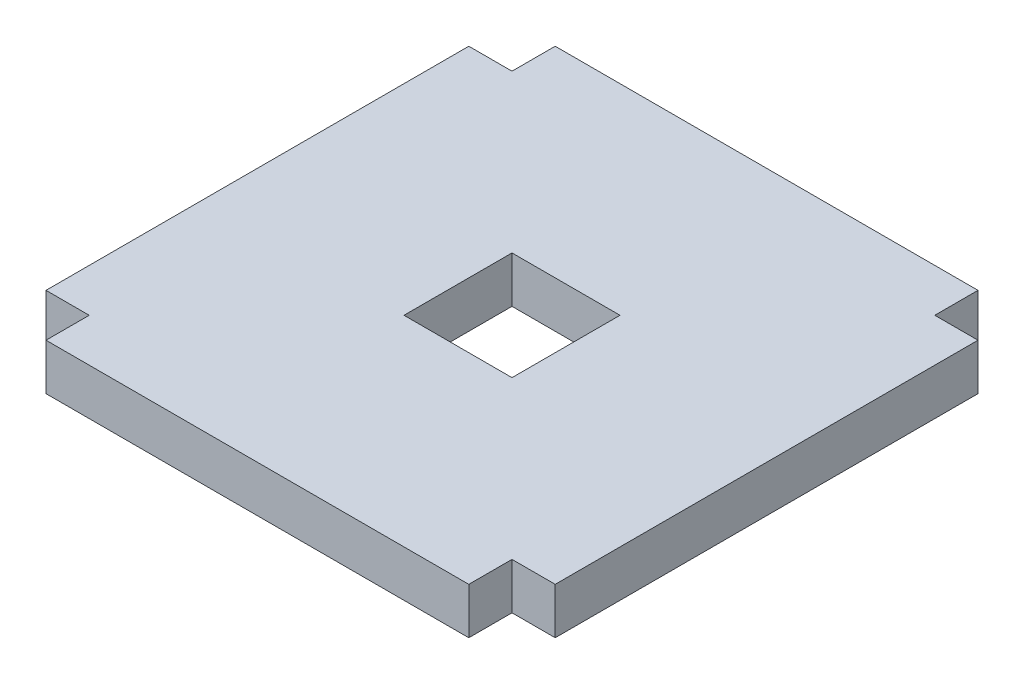
ISO-10303-21;
HEADER;
FILE_DESCRIPTION(('STEP AP214'),'2;1');
FILE_NAME('part.step','',(''),(''),'','','');
FILE_SCHEMA(('AUTOMOTIVE_DESIGN { 1 0 10303 214 1 1 1 1 }'));
ENDSEC;
DATA;
#1=APPLICATION_CONTEXT('core data for automotive mechanical design processes');
#2=APPLICATION_PROTOCOL_DEFINITION('international standard','automotive_design',2000,#1);
#3=PRODUCT_CONTEXT('',#1,'mechanical');
#4=PRODUCT('Part','Part','',(#3));
#5=PRODUCT_RELATED_PRODUCT_CATEGORY('part','',(#4));
#6=PRODUCT_DEFINITION_FORMATION('','',#4);
#7=PRODUCT_DEFINITION_CONTEXT('part definition',#1,'design');
#8=PRODUCT_DEFINITION('design','',#6,#7);
#9=PRODUCT_DEFINITION_SHAPE('','',#8);
#10=(LENGTH_UNIT() NAMED_UNIT(*) SI_UNIT(.MILLI.,.METRE.));
#11=(NAMED_UNIT(*) PLANE_ANGLE_UNIT() SI_UNIT($,.RADIAN.));
#12=(NAMED_UNIT(*) SI_UNIT($,.STERADIAN.) SOLID_ANGLE_UNIT());
#13=UNCERTAINTY_MEASURE_WITH_UNIT(LENGTH_MEASURE(1.E-05),#10,'distance_accuracy_value','');
#14=(GEOMETRIC_REPRESENTATION_CONTEXT(3) GLOBAL_UNCERTAINTY_ASSIGNED_CONTEXT((#13)) GLOBAL_UNIT_ASSIGNED_CONTEXT((#10,
#11,#12)) REPRESENTATION_CONTEXT('',''));
#15=CARTESIAN_POINT('',(0.,0.,0.));
#16=DIRECTION('',(0.,0.,1.));
#17=DIRECTION('',(1.,0.,0.));
#18=AXIS2_PLACEMENT_3D('',#15,#16,#17);
#19=CARTESIAN_POINT('',(0.,19.05,86.995));
#20=DIRECTION('',(0.,0.,1.));
#21=DIRECTION('',(1.,0.,0.));
#22=AXIS2_PLACEMENT_3D('',#19,#20,#21);
#23=PLANE('',#22);
#24=DIRECTION('',(-1.,0.,0.));
#25=VECTOR('',#24,1.);
#26=CARTESIAN_POINT('',(0.,0.,86.995));
#27=LINE('',#26,#25);
#28=CARTESIAN_POINT('',(-86.995,0.,86.995));
#29=VERTEX_POINT('',#28);
#30=CARTESIAN_POINT('',(-104.775,0.,86.995));
#31=VERTEX_POINT('',#30);
#32=EDGE_CURVE('E209',#29,#31,#27,.T.);
#33=ORIENTED_EDGE('',*,*,#32,.F.);
#34=DIRECTION('',(0.,-1.,0.));
#35=VECTOR('',#34,1.);
#36=CARTESIAN_POINT('',(-86.995,19.05,86.995));
#37=LINE('',#36,#35);
#38=CARTESIAN_POINT('',(-86.995,19.05,86.995));
#39=VERTEX_POINT('',#38);
#40=EDGE_CURVE('E11',#39,#29,#37,.T.);
#41=ORIENTED_EDGE('',*,*,#40,.F.);
#42=DIRECTION('',(-1.,0.,0.));
#43=VECTOR('',#42,1.);
#44=CARTESIAN_POINT('',(0.,19.05,86.995));
#45=LINE('',#44,#43);
#46=CARTESIAN_POINT('',(-104.775,19.05,86.995));
#47=VERTEX_POINT('',#46);
#48=EDGE_CURVE('E312',#39,#47,#45,.T.);
#49=ORIENTED_EDGE('',*,*,#48,.T.);
#50=DIRECTION('',(0.,-1.,0.));
#51=VECTOR('',#50,1.);
#52=CARTESIAN_POINT('',(-104.775,19.05,86.995));
#53=LINE('',#52,#51);
#54=EDGE_CURVE('E61',#47,#31,#53,.T.);
#55=ORIENTED_EDGE('',*,*,#54,.T.);
#56=EDGE_LOOP('',(#33,#41,#49,#55));
#57=FACE_BOUND('',#56,.T.);
#58=ADVANCED_FACE('F41',(#57),#23,.T.);
#59=CARTESIAN_POINT('',(-86.995,19.05,0.));
#60=DIRECTION('',(-1.,0.,0.));
#61=DIRECTION('',(0.,0.,1.));
#62=AXIS2_PLACEMENT_3D('',#59,#60,#61);
#63=PLANE('',#62);
#64=DIRECTION('',(0.,0.,-1.));
#65=VECTOR('',#64,1.);
#66=CARTESIAN_POINT('',(-86.995,0.,0.));
#67=LINE('',#66,#65);
#68=CARTESIAN_POINT('',(-86.995,0.,104.775));
#69=VERTEX_POINT('',#68);
#70=EDGE_CURVE('E212',#69,#29,#67,.T.);
#71=ORIENTED_EDGE('',*,*,#70,.F.);
#72=DIRECTION('',(0.,-1.,0.));
#73=VECTOR('',#72,1.);
#74=CARTESIAN_POINT('',(-86.995,19.05,104.775));
#75=LINE('',#74,#73);
#76=CARTESIAN_POINT('',(-86.995,19.05,104.775));
#77=VERTEX_POINT('',#76);
#78=EDGE_CURVE('E52',#77,#69,#75,.T.);
#79=ORIENTED_EDGE('',*,*,#78,.F.);
#80=DIRECTION('',(0.,0.,-1.));
#81=VECTOR('',#80,1.);
#82=CARTESIAN_POINT('',(-86.995,19.05,0.));
#83=LINE('',#82,#81);
#84=EDGE_CURVE('E317',#77,#39,#83,.T.);
#85=ORIENTED_EDGE('',*,*,#84,.T.);
#86=ORIENTED_EDGE('',*,*,#40,.T.);
#87=EDGE_LOOP('',(#71,#79,#85,#86));
#88=FACE_BOUND('',#87,.T.);
#89=ADVANCED_FACE('F363',(#88),#63,.T.);
#90=CARTESIAN_POINT('',(0.,19.05,104.775));
#91=DIRECTION('',(0.,0.,-1.));
#92=DIRECTION('',(-1.,0.,0.));
#93=AXIS2_PLACEMENT_3D('',#90,#91,#92);
#94=PLANE('',#93);
#95=DIRECTION('',(1.,0.,0.));
#96=VECTOR('',#95,1.);
#97=CARTESIAN_POINT('',(0.,0.,104.775));
#98=LINE('',#97,#96);
#99=CARTESIAN_POINT('',(86.995,0.,104.775));
#100=VERTEX_POINT('',#99);
#101=EDGE_CURVE('E216',#69,#100,#98,.T.);
#102=ORIENTED_EDGE('',*,*,#101,.T.);
#103=DIRECTION('',(0.,-1.,0.));
#104=VECTOR('',#103,1.);
#105=CARTESIAN_POINT('',(86.995,19.05,104.775));
#106=LINE('',#105,#104);
#107=CARTESIAN_POINT('',(86.995,19.05,104.775));
#108=VERTEX_POINT('',#107);
#109=EDGE_CURVE('E277',#108,#100,#106,.T.);
#110=ORIENTED_EDGE('',*,*,#109,.F.);
#111=DIRECTION('',(1.,0.,0.));
#112=VECTOR('',#111,1.);
#113=CARTESIAN_POINT('',(0.,19.05,104.775));
#114=LINE('',#113,#112);
#115=EDGE_CURVE('E325',#77,#108,#114,.T.);
#116=ORIENTED_EDGE('',*,*,#115,.F.);
#117=ORIENTED_EDGE('',*,*,#78,.T.);
#118=EDGE_LOOP('',(#102,#110,#116,#117));
#119=FACE_BOUND('',#118,.T.);
#120=ADVANCED_FACE('F368',(#119),#94,.F.);
#121=CARTESIAN_POINT('',(86.995,19.05,0.));
#122=DIRECTION('',(1.,0.,0.));
#123=DIRECTION('',(0.,0.,-1.));
#124=AXIS2_PLACEMENT_3D('',#121,#122,#123);
#125=PLANE('',#124);
#126=DIRECTION('',(0.,0.,1.));
#127=VECTOR('',#126,1.);
#128=CARTESIAN_POINT('',(86.995,0.,0.));
#129=LINE('',#128,#127);
#130=CARTESIAN_POINT('',(86.995,0.,86.995));
#131=VERTEX_POINT('',#130);
#132=EDGE_CURVE('E220',#131,#100,#129,.T.);
#133=ORIENTED_EDGE('',*,*,#132,.F.);
#134=DIRECTION('',(0.,-1.,0.));
#135=VECTOR('',#134,1.);
#136=CARTESIAN_POINT('',(86.995,19.05,86.995));
#137=LINE('',#136,#135);
#138=CARTESIAN_POINT('',(86.995,19.05,86.995));
#139=VERTEX_POINT('',#138);
#140=EDGE_CURVE('E274',#139,#131,#137,.T.);
#141=ORIENTED_EDGE('',*,*,#140,.F.);
#142=DIRECTION('',(0.,0.,1.));
#143=VECTOR('',#142,1.);
#144=CARTESIAN_POINT('',(86.995,19.05,0.));
#145=LINE('',#144,#143);
#146=EDGE_CURVE('E328',#139,#108,#145,.T.);
#147=ORIENTED_EDGE('',*,*,#146,.T.);
#148=ORIENTED_EDGE('',*,*,#109,.T.);
#149=EDGE_LOOP('',(#133,#141,#147,#148));
#150=FACE_BOUND('',#149,.T.);
#151=ADVANCED_FACE('F403',(#150),#125,.T.);
#152=CARTESIAN_POINT('',(0.,19.05,86.995));
#153=DIRECTION('',(0.,0.,1.));
#154=DIRECTION('',(1.,0.,0.));
#155=AXIS2_PLACEMENT_3D('',#152,#153,#154);
#156=PLANE('',#155);
#157=DIRECTION('',(-1.,0.,0.));
#158=VECTOR('',#157,1.);
#159=CARTESIAN_POINT('',(0.,0.,86.995));
#160=LINE('',#159,#158);
#161=CARTESIAN_POINT('',(104.775,0.,86.995));
#162=VERTEX_POINT('',#161);
#163=EDGE_CURVE('E224',#162,#131,#160,.T.);
#164=ORIENTED_EDGE('',*,*,#163,.F.);
#165=DIRECTION('',(0.,-1.,0.));
#166=VECTOR('',#165,1.);
#167=CARTESIAN_POINT('',(104.775,19.05,86.995));
#168=LINE('',#167,#166);
#169=CARTESIAN_POINT('',(104.775,19.05,86.995));
#170=VERTEX_POINT('',#169);
#171=EDGE_CURVE('E271',#170,#162,#168,.T.);
#172=ORIENTED_EDGE('',*,*,#171,.F.);
#173=DIRECTION('',(-1.,0.,0.));
#174=VECTOR('',#173,1.);
#175=CARTESIAN_POINT('',(0.,19.05,86.995));
#176=LINE('',#175,#174);
#177=EDGE_CURVE('E332',#170,#139,#176,.T.);
#178=ORIENTED_EDGE('',*,*,#177,.T.);
#179=ORIENTED_EDGE('',*,*,#140,.T.);
#180=EDGE_LOOP('',(#164,#172,#178,#179));
#181=FACE_BOUND('',#180,.T.);
#182=ADVANCED_FACE('F399',(#181),#156,.T.);
#183=CARTESIAN_POINT('',(104.775,19.05,0.));
#184=DIRECTION('',(-1.,0.,0.));
#185=DIRECTION('',(0.,0.,1.));
#186=AXIS2_PLACEMENT_3D('',#183,#184,#185);
#187=PLANE('',#186);
#188=DIRECTION('',(0.,0.,-1.));
#189=VECTOR('',#188,1.);
#190=CARTESIAN_POINT('',(104.775,0.,0.));
#191=LINE('',#190,#189);
#192=CARTESIAN_POINT('',(104.775,0.,-86.995));
#193=VERTEX_POINT('',#192);
#194=EDGE_CURVE('E228',#162,#193,#191,.T.);
#195=ORIENTED_EDGE('',*,*,#194,.T.);
#196=DIRECTION('',(0.,-1.,0.));
#197=VECTOR('',#196,1.);
#198=CARTESIAN_POINT('',(104.775,19.05,-86.995));
#199=LINE('',#198,#197);
#200=CARTESIAN_POINT('',(104.775,19.05,-86.995));
#201=VERTEX_POINT('',#200);
#202=EDGE_CURVE('E267',#201,#193,#199,.T.);
#203=ORIENTED_EDGE('',*,*,#202,.F.);
#204=DIRECTION('',(0.,0.,-1.));
#205=VECTOR('',#204,1.);
#206=CARTESIAN_POINT('',(104.775,19.05,0.));
#207=LINE('',#206,#205);
#208=EDGE_CURVE('E336',#170,#201,#207,.T.);
#209=ORIENTED_EDGE('',*,*,#208,.F.);
#210=ORIENTED_EDGE('',*,*,#171,.T.);
#211=EDGE_LOOP('',(#195,#203,#209,#210));
#212=FACE_BOUND('',#211,.T.);
#213=ADVANCED_FACE('F395',(#212),#187,.F.);
#214=CARTESIAN_POINT('',(0.,19.05,-86.995));
#215=DIRECTION('',(0.,0.,1.));
#216=DIRECTION('',(1.,0.,0.));
#217=AXIS2_PLACEMENT_3D('',#214,#215,#216);
#218=PLANE('',#217);
#219=DIRECTION('',(-1.,0.,0.));
#220=VECTOR('',#219,1.);
#221=CARTESIAN_POINT('',(0.,0.,-86.995));
#222=LINE('',#221,#220);
#223=CARTESIAN_POINT('',(86.995,0.,-86.995));
#224=VERTEX_POINT('',#223);
#225=EDGE_CURVE('E232',#193,#224,#222,.T.);
#226=ORIENTED_EDGE('',*,*,#225,.T.);
#227=DIRECTION('',(0.,-1.,0.));
#228=VECTOR('',#227,1.);
#229=CARTESIAN_POINT('',(86.995,19.05,-86.995));
#230=LINE('',#229,#228);
#231=CARTESIAN_POINT('',(86.995,19.05,-86.995));
#232=VERTEX_POINT('',#231);
#233=EDGE_CURVE('E263',#232,#224,#230,.T.);
#234=ORIENTED_EDGE('',*,*,#233,.F.);
#235=DIRECTION('',(-1.,0.,0.));
#236=VECTOR('',#235,1.);
#237=CARTESIAN_POINT('',(0.,19.05,-86.995));
#238=LINE('',#237,#236);
#239=EDGE_CURVE('E340',#201,#232,#238,.T.);
#240=ORIENTED_EDGE('',*,*,#239,.F.);
#241=ORIENTED_EDGE('',*,*,#202,.T.);
#242=EDGE_LOOP('',(#226,#234,#240,#241));
#243=FACE_BOUND('',#242,.T.);
#244=ADVANCED_FACE('F391',(#243),#218,.F.);
#245=CARTESIAN_POINT('',(86.9949999999999,19.05,0.));
#246=DIRECTION('',(-1.,0.,0.));
#247=DIRECTION('',(0.,0.,1.));
#248=AXIS2_PLACEMENT_3D('',#245,#246,#247);
#249=PLANE('',#248);
#250=DIRECTION('',(0.,0.,-1.));
#251=VECTOR('',#250,1.);
#252=CARTESIAN_POINT('',(86.9949999999999,0.,0.));
#253=LINE('',#252,#251);
#254=CARTESIAN_POINT('',(86.995,0.,-104.775));
#255=VERTEX_POINT('',#254);
#256=EDGE_CURVE('E236',#224,#255,#253,.T.);
#257=ORIENTED_EDGE('',*,*,#256,.T.);
#258=DIRECTION('',(0.,-1.,0.));
#259=VECTOR('',#258,1.);
#260=CARTESIAN_POINT('',(86.995,19.05,-104.775));
#261=LINE('',#260,#259);
#262=CARTESIAN_POINT('',(86.995,19.05,-104.775));
#263=VERTEX_POINT('',#262);
#264=EDGE_CURVE('E260',#263,#255,#261,.T.);
#265=ORIENTED_EDGE('',*,*,#264,.F.);
#266=DIRECTION('',(0.,0.,-1.));
#267=VECTOR('',#266,1.);
#268=CARTESIAN_POINT('',(86.9949999999999,19.05,0.));
#269=LINE('',#268,#267);
#270=EDGE_CURVE('E344',#232,#263,#269,.T.);
#271=ORIENTED_EDGE('',*,*,#270,.F.);
#272=ORIENTED_EDGE('',*,*,#233,.T.);
#273=EDGE_LOOP('',(#257,#265,#271,#272));
#274=FACE_BOUND('',#273,.T.);
#275=ADVANCED_FACE('F388',(#274),#249,.F.);
#276=CARTESIAN_POINT('',(0.,19.05,-104.775));
#277=DIRECTION('',(0.,0.,-1.));
#278=DIRECTION('',(-1.,0.,0.));
#279=AXIS2_PLACEMENT_3D('',#276,#277,#278);
#280=PLANE('',#279);
#281=DIRECTION('',(1.,0.,0.));
#282=VECTOR('',#281,1.);
#283=CARTESIAN_POINT('',(0.,0.,-104.775));
#284=LINE('',#283,#282);
#285=CARTESIAN_POINT('',(-86.995,0.,-104.775));
#286=VERTEX_POINT('',#285);
#287=EDGE_CURVE('E240',#286,#255,#284,.T.);
#288=ORIENTED_EDGE('',*,*,#287,.F.);
#289=DIRECTION('',(0.,-1.,0.));
#290=VECTOR('',#289,1.);
#291=CARTESIAN_POINT('',(-86.995,19.05,-104.775));
#292=LINE('',#291,#290);
#293=CARTESIAN_POINT('',(-86.995,19.05,-104.775));
#294=VERTEX_POINT('',#293);
#295=EDGE_CURVE('E172',#294,#286,#292,.T.);
#296=ORIENTED_EDGE('',*,*,#295,.F.);
#297=DIRECTION('',(1.,0.,0.));
#298=VECTOR('',#297,1.);
#299=CARTESIAN_POINT('',(0.,19.05,-104.775));
#300=LINE('',#299,#298);
#301=EDGE_CURVE('E182',#294,#263,#300,.T.);
#302=ORIENTED_EDGE('',*,*,#301,.T.);
#303=ORIENTED_EDGE('',*,*,#264,.T.);
#304=EDGE_LOOP('',(#288,#296,#302,#303));
#305=FACE_BOUND('',#304,.T.);
#306=ADVANCED_FACE('F349',(#305),#280,.T.);
#307=CARTESIAN_POINT('',(-86.995,19.05,0.));
#308=DIRECTION('',(-1.,0.,0.));
#309=DIRECTION('',(0.,0.,1.));
#310=AXIS2_PLACEMENT_3D('',#307,#308,#309);
#311=PLANE('',#310);
#312=DIRECTION('',(0.,0.,-1.));
#313=VECTOR('',#312,1.);
#314=CARTESIAN_POINT('',(-86.995,0.,0.));
#315=LINE('',#314,#313);
#316=CARTESIAN_POINT('',(-86.995,0.,-86.995));
#317=VERTEX_POINT('',#316);
#318=EDGE_CURVE('E167',#317,#286,#315,.T.);
#319=ORIENTED_EDGE('',*,*,#318,.F.);
#320=DIRECTION('',(0.,-1.,0.));
#321=VECTOR('',#320,1.);
#322=CARTESIAN_POINT('',(-86.995,19.05,-86.995));
#323=LINE('',#322,#321);
#324=CARTESIAN_POINT('',(-86.995,19.05,-86.995));
#325=VERTEX_POINT('',#324);
#326=EDGE_CURVE('E162',#325,#317,#323,.T.);
#327=ORIENTED_EDGE('',*,*,#326,.F.);
#328=DIRECTION('',(0.,0.,-1.));
#329=VECTOR('',#328,1.);
#330=CARTESIAN_POINT('',(-86.995,19.05,0.));
#331=LINE('',#330,#329);
#332=EDGE_CURVE('E165',#325,#294,#331,.T.);
#333=ORIENTED_EDGE('',*,*,#332,.T.);
#334=ORIENTED_EDGE('',*,*,#295,.T.);
#335=EDGE_LOOP('',(#319,#327,#333,#334));
#336=FACE_BOUND('',#335,.T.);
#337=ADVANCED_FACE('F164',(#336),#311,.T.);
#338=CARTESIAN_POINT('',(0.,19.05,-86.995));
#339=DIRECTION('',(0.,0.,-1.));
#340=DIRECTION('',(-1.,0.,0.));
#341=AXIS2_PLACEMENT_3D('',#338,#339,#340);
#342=PLANE('',#341);
#343=DIRECTION('',(1.,0.,0.));
#344=VECTOR('',#343,1.);
#345=CARTESIAN_POINT('',(0.,0.,-86.995));
#346=LINE('',#345,#344);
#347=CARTESIAN_POINT('',(-104.775,0.,-86.995));
#348=VERTEX_POINT('',#347);
#349=EDGE_CURVE('E246',#348,#317,#346,.T.);
#350=ORIENTED_EDGE('',*,*,#349,.F.);
#351=DIRECTION('',(0.,-1.,0.));
#352=VECTOR('',#351,1.);
#353=CARTESIAN_POINT('',(-104.775,19.05,-86.995));
#354=LINE('',#353,#352);
#355=CARTESIAN_POINT('',(-104.775,19.05,-86.995));
#356=VERTEX_POINT('',#355);
#357=EDGE_CURVE('E110',#356,#348,#354,.T.);
#358=ORIENTED_EDGE('',*,*,#357,.F.);
#359=DIRECTION('',(1.,0.,0.));
#360=VECTOR('',#359,1.);
#361=CARTESIAN_POINT('',(0.,19.05,-86.995));
#362=LINE('',#361,#360);
#363=EDGE_CURVE('E180',#356,#325,#362,.T.);
#364=ORIENTED_EDGE('',*,*,#363,.T.);
#365=ORIENTED_EDGE('',*,*,#326,.T.);
#366=EDGE_LOOP('',(#350,#358,#364,#365));
#367=FACE_BOUND('',#366,.T.);
#368=ADVANCED_FACE('F185',(#367),#342,.T.);
#369=CARTESIAN_POINT('',(22.225,19.05,0.));
#370=DIRECTION('',(-1.,0.,0.));
#371=DIRECTION('',(0.,0.,1.));
#372=AXIS2_PLACEMENT_3D('',#369,#370,#371);
#373=PLANE('',#372);
#374=DIRECTION('',(0.,0.,-1.));
#375=VECTOR('',#374,1.);
#376=CARTESIAN_POINT('',(22.225,0.,0.));
#377=LINE('',#376,#375);
#378=CARTESIAN_POINT('',(22.225,0.,22.225));
#379=VERTEX_POINT('',#378);
#380=CARTESIAN_POINT('',(22.225,0.,-22.225));
#381=VERTEX_POINT('',#380);
#382=EDGE_CURVE('E194',#379,#381,#377,.T.);
#383=ORIENTED_EDGE('',*,*,#382,.F.);
#384=DIRECTION('',(0.,-1.,0.));
#385=VECTOR('',#384,1.);
#386=CARTESIAN_POINT('',(22.225,19.05,22.225));
#387=LINE('',#386,#385);
#388=CARTESIAN_POINT('',(22.225,19.05,22.225));
#389=VERTEX_POINT('',#388);
#390=EDGE_CURVE('E45',#389,#379,#387,.T.);
#391=ORIENTED_EDGE('',*,*,#390,.F.);
#392=DIRECTION('',(0.,0.,-1.));
#393=VECTOR('',#392,1.);
#394=CARTESIAN_POINT('',(22.225,19.05,0.));
#395=LINE('',#394,#393);
#396=CARTESIAN_POINT('',(22.225,19.05,-22.225));
#397=VERTEX_POINT('',#396);
#398=EDGE_CURVE('E253',#389,#397,#395,.T.);
#399=ORIENTED_EDGE('',*,*,#398,.T.);
#400=DIRECTION('',(0.,-1.,0.));
#401=VECTOR('',#400,1.);
#402=CARTESIAN_POINT('',(22.225,19.05,-22.225));
#403=LINE('',#402,#401);
#404=EDGE_CURVE('E190',#397,#381,#403,.T.);
#405=ORIENTED_EDGE('',*,*,#404,.T.);
#406=EDGE_LOOP('',(#383,#391,#399,#405));
#407=FACE_BOUND('',#406,.T.);
#408=ADVANCED_FACE('F43',(#407),#373,.T.);
#409=CARTESIAN_POINT('',(0.,19.05,22.225));
#410=DIRECTION('',(0.,0.,-1.));
#411=DIRECTION('',(-1.,0.,0.));
#412=AXIS2_PLACEMENT_3D('',#409,#410,#411);
#413=PLANE('',#412);
#414=DIRECTION('',(1.,0.,0.));
#415=VECTOR('',#414,1.);
#416=CARTESIAN_POINT('',(0.,0.,22.225));
#417=LINE('',#416,#415);
#418=CARTESIAN_POINT('',(-22.225,0.,22.225));
#419=VERTEX_POINT('',#418);
#420=EDGE_CURVE('E198',#419,#379,#417,.T.);
#421=ORIENTED_EDGE('',*,*,#420,.F.);
#422=DIRECTION('',(0.,-1.,0.));
#423=VECTOR('',#422,1.);
#424=CARTESIAN_POINT('',(-22.225,19.05,22.225));
#425=LINE('',#424,#423);
#426=CARTESIAN_POINT('',(-22.225,19.05,22.225));
#427=VERTEX_POINT('',#426);
#428=EDGE_CURVE('E287',#427,#419,#425,.T.);
#429=ORIENTED_EDGE('',*,*,#428,.F.);
#430=DIRECTION('',(1.,0.,0.));
#431=VECTOR('',#430,1.);
#432=CARTESIAN_POINT('',(0.,19.05,22.225));
#433=LINE('',#432,#431);
#434=EDGE_CURVE('E298',#427,#389,#433,.T.);
#435=ORIENTED_EDGE('',*,*,#434,.T.);
#436=ORIENTED_EDGE('',*,*,#390,.T.);
#437=EDGE_LOOP('',(#421,#429,#435,#436));
#438=FACE_BOUND('',#437,.T.);
#439=ADVANCED_FACE('F296',(#438),#413,.T.);
#440=CARTESIAN_POINT('',(-22.225,19.05,0.));
#441=DIRECTION('',(-1.,0.,0.));
#442=DIRECTION('',(0.,0.,1.));
#443=AXIS2_PLACEMENT_3D('',#440,#441,#442);
#444=PLANE('',#443);
#445=DIRECTION('',(0.,0.,-1.));
#446=VECTOR('',#445,1.);
#447=CARTESIAN_POINT('',(-22.225,0.,0.));
#448=LINE('',#447,#446);
#449=CARTESIAN_POINT('',(-22.225,0.,-22.225));
#450=VERTEX_POINT('',#449);
#451=EDGE_CURVE('E202',#419,#450,#448,.T.);
#452=ORIENTED_EDGE('',*,*,#451,.T.);
#453=DIRECTION('',(0.,-1.,0.));
#454=VECTOR('',#453,1.);
#455=CARTESIAN_POINT('',(-22.225,19.05,-22.225));
#456=LINE('',#455,#454);
#457=CARTESIAN_POINT('',(-22.225,19.05,-22.225));
#458=VERTEX_POINT('',#457);
#459=EDGE_CURVE('E284',#458,#450,#456,.T.);
#460=ORIENTED_EDGE('',*,*,#459,.F.);
#461=DIRECTION('',(0.,0.,-1.));
#462=VECTOR('',#461,1.);
#463=CARTESIAN_POINT('',(-22.225,19.05,0.));
#464=LINE('',#463,#462);
#465=EDGE_CURVE('E313',#427,#458,#464,.T.);
#466=ORIENTED_EDGE('',*,*,#465,.F.);
#467=ORIENTED_EDGE('',*,*,#428,.T.);
#468=EDGE_LOOP('',(#452,#460,#466,#467));
#469=FACE_BOUND('',#468,.T.);
#470=ADVANCED_FACE('F305',(#469),#444,.F.);
#471=CARTESIAN_POINT('',(0.,19.05,-22.225));
#472=DIRECTION('',(0.,0.,-1.));
#473=DIRECTION('',(-1.,0.,0.));
#474=AXIS2_PLACEMENT_3D('',#471,#472,#473);
#475=PLANE('',#474);
#476=DIRECTION('',(1.,0.,0.));
#477=VECTOR('',#476,1.);
#478=CARTESIAN_POINT('',(0.,0.,-22.225));
#479=LINE('',#478,#477);
#480=EDGE_CURVE('E205',#450,#381,#479,.T.);
#481=ORIENTED_EDGE('',*,*,#480,.T.);
#482=ORIENTED_EDGE('',*,*,#404,.F.);
#483=DIRECTION('',(1.,0.,0.));
#484=VECTOR('',#483,1.);
#485=CARTESIAN_POINT('',(0.,19.05,-22.225));
#486=LINE('',#485,#484);
#487=EDGE_CURVE('E309',#458,#397,#486,.T.);
#488=ORIENTED_EDGE('',*,*,#487,.F.);
#489=ORIENTED_EDGE('',*,*,#459,.T.);
#490=EDGE_LOOP('',(#481,#482,#488,#489));
#491=FACE_BOUND('',#490,.T.);
#492=ADVANCED_FACE('F308',(#491),#475,.F.);
#493=CARTESIAN_POINT('',(-104.775,19.05,0.));
#494=DIRECTION('',(-1.,0.,0.));
#495=DIRECTION('',(0.,0.,1.));
#496=AXIS2_PLACEMENT_3D('',#493,#494,#495);
#497=PLANE('',#496);
#498=DIRECTION('',(0.,0.,-1.));
#499=VECTOR('',#498,1.);
#500=CARTESIAN_POINT('',(-104.775,0.,0.));
#501=LINE('',#500,#499);
#502=EDGE_CURVE('E249',#31,#348,#501,.T.);
#503=ORIENTED_EDGE('',*,*,#502,.F.);
#504=ORIENTED_EDGE('',*,*,#54,.F.);
#505=DIRECTION('',(0.,0.,-1.));
#506=VECTOR('',#505,1.);
#507=CARTESIAN_POINT('',(-104.775,19.05,0.));
#508=LINE('',#507,#506);
#509=EDGE_CURVE('E187',#47,#356,#508,.T.);
#510=ORIENTED_EDGE('',*,*,#509,.T.);
#511=ORIENTED_EDGE('',*,*,#357,.T.);
#512=EDGE_LOOP('',(#503,#504,#510,#511));
#513=FACE_BOUND('',#512,.T.);
#514=ADVANCED_FACE('F351',(#513),#497,.T.);
#515=CARTESIAN_POINT('',(0.,19.05,0.));
#516=DIRECTION('',(0.,1.,0.));
#517=DIRECTION('',(0.,0.,1.));
#518=AXIS2_PLACEMENT_3D('',#515,#516,#517);
#519=PLANE('',#518);
#520=ORIENTED_EDGE('',*,*,#398,.F.);
#521=ORIENTED_EDGE('',*,*,#434,.F.);
#522=ORIENTED_EDGE('',*,*,#465,.T.);
#523=ORIENTED_EDGE('',*,*,#487,.T.);
#524=EDGE_LOOP('',(#520,#521,#522,#523));
#525=FACE_BOUND('',#524,.T.);
#526=ORIENTED_EDGE('',*,*,#48,.F.);
#527=ORIENTED_EDGE('',*,*,#84,.F.);
#528=ORIENTED_EDGE('',*,*,#115,.T.);
#529=ORIENTED_EDGE('',*,*,#146,.F.);
#530=ORIENTED_EDGE('',*,*,#177,.F.);
#531=ORIENTED_EDGE('',*,*,#208,.T.);
#532=ORIENTED_EDGE('',*,*,#239,.T.);
#533=ORIENTED_EDGE('',*,*,#270,.T.);
#534=ORIENTED_EDGE('',*,*,#301,.F.);
#535=ORIENTED_EDGE('',*,*,#332,.F.);
#536=ORIENTED_EDGE('',*,*,#363,.F.);
#537=ORIENTED_EDGE('',*,*,#509,.F.);
#538=EDGE_LOOP('',(#526,#527,#528,#529,#530,#531,#532,#533,#534,#535,#536,#537));
#539=FACE_BOUND('',#538,.T.);
#540=ADVANCED_FACE('F178',(#525,#539),#519,.T.);
#541=CARTESIAN_POINT('',(0.,0.,0.));
#542=DIRECTION('',(0.,1.,0.));
#543=DIRECTION('',(0.,0.,1.));
#544=AXIS2_PLACEMENT_3D('',#541,#542,#543);
#545=PLANE('',#544);
#546=ORIENTED_EDGE('',*,*,#382,.T.);
#547=ORIENTED_EDGE('',*,*,#480,.F.);
#548=ORIENTED_EDGE('',*,*,#451,.F.);
#549=ORIENTED_EDGE('',*,*,#420,.T.);
#550=EDGE_LOOP('',(#546,#547,#548,#549));
#551=FACE_BOUND('',#550,.T.);
#552=ORIENTED_EDGE('',*,*,#32,.T.);
#553=ORIENTED_EDGE('',*,*,#502,.T.);
#554=ORIENTED_EDGE('',*,*,#349,.T.);
#555=ORIENTED_EDGE('',*,*,#318,.T.);
#556=ORIENTED_EDGE('',*,*,#287,.T.);
#557=ORIENTED_EDGE('',*,*,#256,.F.);
#558=ORIENTED_EDGE('',*,*,#225,.F.);
#559=ORIENTED_EDGE('',*,*,#194,.F.);
#560=ORIENTED_EDGE('',*,*,#163,.T.);
#561=ORIENTED_EDGE('',*,*,#132,.T.);
#562=ORIENTED_EDGE('',*,*,#101,.F.);
#563=ORIENTED_EDGE('',*,*,#70,.T.);
#564=EDGE_LOOP('',(#552,#553,#554,#555,#556,#557,#558,#559,#560,#561,#562,#563));
#565=FACE_BOUND('',#564,.T.);
#566=ADVANCED_FACE('F302',(#551,#565),#545,.F.);
#567=CLOSED_SHELL('',(#58,#89,#120,#151,#182,#213,#244,#275,#306,#337,#368,#408,#439,#470,#492,
#514,#540,#566));
#568=MANIFOLD_SOLID_BREP('B2',#567);
#569=ADVANCED_BREP_SHAPE_REPRESENTATION('',(#18,#568),#14);
#570=SHAPE_DEFINITION_REPRESENTATION(#9,#569);
ENDSEC;
END-ISO-10303-21;
